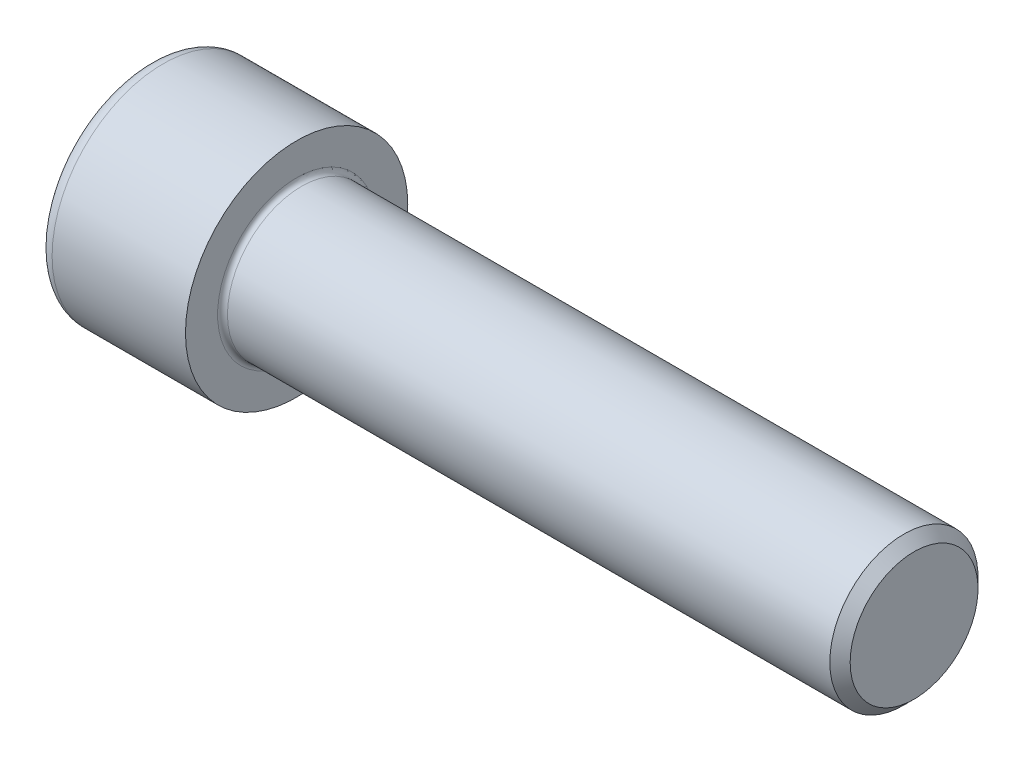
ISO-10303-21;
HEADER;
FILE_DESCRIPTION(('STEP AP214'),'2;1');
FILE_NAME('part.step','',(''),(''),'','','');
FILE_SCHEMA(('AUTOMOTIVE_DESIGN { 1 0 10303 214 1 1 1 1 }'));
ENDSEC;
DATA;
#1=APPLICATION_CONTEXT('core data for automotive mechanical design processes');
#2=APPLICATION_PROTOCOL_DEFINITION('international standard','automotive_design',2000,#1);
#3=PRODUCT_CONTEXT('',#1,'mechanical');
#4=PRODUCT('Part','Part','',(#3));
#5=PRODUCT_RELATED_PRODUCT_CATEGORY('part','',(#4));
#6=PRODUCT_DEFINITION_FORMATION('','',#4);
#7=PRODUCT_DEFINITION_CONTEXT('part definition',#1,'design');
#8=PRODUCT_DEFINITION('design','',#6,#7);
#9=PRODUCT_DEFINITION_SHAPE('','',#8);
#10=(LENGTH_UNIT() NAMED_UNIT(*) SI_UNIT(.MILLI.,.METRE.));
#11=(NAMED_UNIT(*) PLANE_ANGLE_UNIT() SI_UNIT($,.RADIAN.));
#12=(NAMED_UNIT(*) SI_UNIT($,.STERADIAN.) SOLID_ANGLE_UNIT());
#13=UNCERTAINTY_MEASURE_WITH_UNIT(LENGTH_MEASURE(1.E-05),#10,'distance_accuracy_value','');
#14=(GEOMETRIC_REPRESENTATION_CONTEXT(3) GLOBAL_UNCERTAINTY_ASSIGNED_CONTEXT((#13)) GLOBAL_UNIT_ASSIGNED_CONTEXT((#10,
#11,#12)) REPRESENTATION_CONTEXT('',''));
#15=CARTESIAN_POINT('',(0.,0.,0.));
#16=DIRECTION('',(0.,0.,1.));
#17=DIRECTION('',(1.,0.,0.));
#18=AXIS2_PLACEMENT_3D('',#15,#16,#17);
#19=CARTESIAN_POINT('',(12.,10.9696551146029,0.));
#20=DIRECTION('',(1.,0.,0.));
#21=DIRECTION('',(0.,0.,-1.));
#22=AXIS2_PLACEMENT_3D('',#19,#20,#21);
#23=PLANE('',#22);
#24=CARTESIAN_POINT('',(12.,0.,0.));
#25=DIRECTION('',(1.,0.,0.));
#26=DIRECTION('',(0.,0.,-1.));
#27=AXIS2_PLACEMENT_3D('',#24,#25,#26);
#28=CIRCLE('',#27,9.5);
#29=CARTESIAN_POINT('',(12.,0.,-9.5));
#30=VERTEX_POINT('',#29);
#31=CARTESIAN_POINT('',(12.,-8.22724133595217,-4.75));
#32=VERTEX_POINT('',#31);
#33=EDGE_CURVE('E156',#30,#32,#28,.F.);
#34=ORIENTED_EDGE('',*,*,#33,.F.);
#35=DIRECTION('',(0.,1.,0.));
#36=VECTOR('',#35,1.);
#37=CARTESIAN_POINT('',(12.,-5.48482755730145,-9.5));
#38=LINE('',#37,#36);
#39=CARTESIAN_POINT('',(12.,-5.48482755730145,-9.5));
#40=VERTEX_POINT('',#39);
#41=EDGE_CURVE('E187',#40,#30,#38,.T.);
#42=ORIENTED_EDGE('',*,*,#41,.F.);
#43=DIRECTION('',(0.,0.5,-0.866025403784439));
#44=VECTOR('',#43,1.);
#45=CARTESIAN_POINT('',(12.,-10.9696551146029,0.));
#46=LINE('',#45,#44);
#47=EDGE_CURVE('E183',#32,#40,#46,.T.);
#48=ORIENTED_EDGE('',*,*,#47,.F.);
#49=EDGE_LOOP('',(#34,#42,#48));
#50=FACE_BOUND('',#49,.T.);
#51=ADVANCED_FACE('F34',(#50),#23,.F.);
#52=CARTESIAN_POINT('',(12.,-8.22724133595216,4.75));
#53=VERTEX_POINT('',#52);
#54=EDGE_CURVE('E262',#32,#53,#28,.F.);
#55=ORIENTED_EDGE('',*,*,#54,.F.);
#56=CARTESIAN_POINT('',(12.,-10.9696551146029,0.));
#57=VERTEX_POINT('',#56);
#58=EDGE_CURVE('E184',#57,#32,#46,.T.);
#59=ORIENTED_EDGE('',*,*,#58,.F.);
#60=DIRECTION('',(0.,-0.5,-0.866025403784438));
#61=VECTOR('',#60,1.);
#62=CARTESIAN_POINT('',(12.,-5.48482755730144,9.5));
#63=LINE('',#62,#61);
#64=EDGE_CURVE('E179',#53,#57,#63,.T.);
#65=ORIENTED_EDGE('',*,*,#64,.F.);
#66=EDGE_LOOP('',(#55,#59,#65));
#67=FACE_BOUND('',#66,.T.);
#68=ADVANCED_FACE('F123',(#67),#23,.F.);
#69=CARTESIAN_POINT('',(12.,0.,9.5));
#70=VERTEX_POINT('',#69);
#71=EDGE_CURVE('E263',#53,#70,#28,.F.);
#72=ORIENTED_EDGE('',*,*,#71,.F.);
#73=CARTESIAN_POINT('',(12.,-5.48482755730144,9.5));
#74=VERTEX_POINT('',#73);
#75=EDGE_CURVE('E180',#74,#53,#63,.T.);
#76=ORIENTED_EDGE('',*,*,#75,.F.);
#77=DIRECTION('',(0.,-1.,0.));
#78=VECTOR('',#77,1.);
#79=CARTESIAN_POINT('',(12.,5.48482755730145,9.5));
#80=LINE('',#79,#78);
#81=EDGE_CURVE('E175',#70,#74,#80,.T.);
#82=ORIENTED_EDGE('',*,*,#81,.F.);
#83=EDGE_LOOP('',(#72,#76,#82));
#84=FACE_BOUND('',#83,.T.);
#85=ADVANCED_FACE('F129',(#84),#23,.F.);
#86=CARTESIAN_POINT('',(12.,8.22724133595217,4.75));
#87=VERTEX_POINT('',#86);
#88=EDGE_CURVE('E265',#70,#87,#28,.F.);
#89=ORIENTED_EDGE('',*,*,#88,.F.);
#90=CARTESIAN_POINT('',(12.,5.48482755730145,9.5));
#91=VERTEX_POINT('',#90);
#92=EDGE_CURVE('E176',#91,#70,#80,.T.);
#93=ORIENTED_EDGE('',*,*,#92,.F.);
#94=DIRECTION('',(0.,-0.5,0.866025403784439));
#95=VECTOR('',#94,1.);
#96=CARTESIAN_POINT('',(12.,10.9696551146029,0.));
#97=LINE('',#96,#95);
#98=EDGE_CURVE('E170',#87,#91,#97,.T.);
#99=ORIENTED_EDGE('',*,*,#98,.F.);
#100=EDGE_LOOP('',(#89,#93,#99));
#101=FACE_BOUND('',#100,.T.);
#102=ADVANCED_FACE('F144',(#101),#23,.F.);
#103=CARTESIAN_POINT('',(12.,8.22724133595217,-4.75));
#104=VERTEX_POINT('',#103);
#105=EDGE_CURVE('E49',#87,#104,#28,.F.);
#106=ORIENTED_EDGE('',*,*,#105,.F.);
#107=CARTESIAN_POINT('',(12.,10.9696551146029,0.));
#108=VERTEX_POINT('',#107);
#109=EDGE_CURVE('E161',#108,#87,#97,.T.);
#110=ORIENTED_EDGE('',*,*,#109,.F.);
#111=DIRECTION('',(0.,0.5,0.866025403784439));
#112=VECTOR('',#111,1.);
#113=CARTESIAN_POINT('',(12.,5.48482755730145,-9.5));
#114=LINE('',#113,#112);
#115=EDGE_CURVE('E158',#104,#108,#114,.T.);
#116=ORIENTED_EDGE('',*,*,#115,.F.);
#117=EDGE_LOOP('',(#106,#110,#116));
#118=FACE_BOUND('',#117,.T.);
#119=ADVANCED_FACE('F135',(#118),#23,.F.);
#120=EDGE_CURVE('E148',#104,#30,#28,.F.);
#121=ORIENTED_EDGE('',*,*,#120,.F.);
#122=CARTESIAN_POINT('',(12.,5.48482755730145,-9.5));
#123=VERTEX_POINT('',#122);
#124=EDGE_CURVE('E151',#123,#104,#114,.T.);
#125=ORIENTED_EDGE('',*,*,#124,.F.);
#126=EDGE_CURVE('E152',#30,#123,#38,.T.);
#127=ORIENTED_EDGE('',*,*,#126,.F.);
#128=EDGE_LOOP('',(#121,#125,#127));
#129=FACE_BOUND('',#128,.T.);
#130=ADVANCED_FACE('F125',(#129),#23,.F.);
#131=CARTESIAN_POINT('',(0.,0.,0.));
#132=DIRECTION('',(1.,0.,0.));
#133=DIRECTION('',(0.,0.,-1.));
#134=AXIS2_PLACEMENT_3D('',#131,#132,#133);
#135=PLANE('',#134);
#136=CARTESIAN_POINT('',(0.,0.,0.));
#137=DIRECTION('',(1.,0.,0.));
#138=DIRECTION('',(0.,0.,-1.));
#139=AXIS2_PLACEMENT_3D('',#136,#137,#138);
#140=CIRCLE('',#139,15.6);
#141=CARTESIAN_POINT('',(0.,0.,-15.6));
#142=VERTEX_POINT('',#141);
#143=EDGE_CURVE('E11',#142,#142,#140,.F.);
#144=ORIENTED_EDGE('',*,*,#143,.T.);
#145=EDGE_LOOP('',(#144));
#146=FACE_BOUND('',#145,.T.);
#147=DIRECTION('',(0.,0.5,0.866025403784439));
#148=VECTOR('',#147,1.);
#149=CARTESIAN_POINT('',(0.,5.48482755730145,-9.5));
#150=LINE('',#149,#148);
#151=CARTESIAN_POINT('',(0.,5.48482755730145,-9.5));
#152=VERTEX_POINT('',#151);
#153=CARTESIAN_POINT('',(0.,10.9696551146029,0.));
#154=VERTEX_POINT('',#153);
#155=EDGE_CURVE('E189',#152,#154,#150,.T.);
#156=ORIENTED_EDGE('',*,*,#155,.T.);
#157=DIRECTION('',(0.,-0.5,0.866025403784439));
#158=VECTOR('',#157,1.);
#159=CARTESIAN_POINT('',(0.,10.9696551146029,0.));
#160=LINE('',#159,#158);
#161=CARTESIAN_POINT('',(0.,5.48482755730145,9.5));
#162=VERTEX_POINT('',#161);
#163=EDGE_CURVE('E191',#154,#162,#160,.T.);
#164=ORIENTED_EDGE('',*,*,#163,.T.);
#165=DIRECTION('',(0.,-1.,0.));
#166=VECTOR('',#165,1.);
#167=CARTESIAN_POINT('',(0.,5.48482755730145,9.5));
#168=LINE('',#167,#166);
#169=CARTESIAN_POINT('',(0.,-5.48482755730144,9.5));
#170=VERTEX_POINT('',#169);
#171=EDGE_CURVE('E193',#162,#170,#168,.T.);
#172=ORIENTED_EDGE('',*,*,#171,.T.);
#173=DIRECTION('',(0.,-0.5,-0.866025403784438));
#174=VECTOR('',#173,1.);
#175=CARTESIAN_POINT('',(0.,-5.48482755730144,9.5));
#176=LINE('',#175,#174);
#177=CARTESIAN_POINT('',(0.,-10.9696551146029,0.));
#178=VERTEX_POINT('',#177);
#179=EDGE_CURVE('E195',#170,#178,#176,.T.);
#180=ORIENTED_EDGE('',*,*,#179,.T.);
#181=DIRECTION('',(0.,0.5,-0.866025403784439));
#182=VECTOR('',#181,1.);
#183=CARTESIAN_POINT('',(0.,-10.9696551146029,0.));
#184=LINE('',#183,#182);
#185=CARTESIAN_POINT('',(0.,-5.48482755730145,-9.5));
#186=VERTEX_POINT('',#185);
#187=EDGE_CURVE('E197',#178,#186,#184,.T.);
#188=ORIENTED_EDGE('',*,*,#187,.T.);
#189=DIRECTION('',(0.,1.,0.));
#190=VECTOR('',#189,1.);
#191=CARTESIAN_POINT('',(0.,-5.48482755730145,-9.5));
#192=LINE('',#191,#190);
#193=EDGE_CURVE('E57',#186,#152,#192,.T.);
#194=ORIENTED_EDGE('',*,*,#193,.T.);
#195=EDGE_LOOP('',(#156,#164,#172,#180,#188,#194));
#196=FACE_BOUND('',#195,.T.);
#197=ADVANCED_FACE('F134',(#146,#196),#135,.F.);
#198=CARTESIAN_POINT('',(24.,0.,0.));
#199=DIRECTION('',(1.,0.,0.));
#200=DIRECTION('',(0.,0.,-1.));
#201=AXIS2_PLACEMENT_3D('',#198,#199,#200);
#202=PLANE('',#201);
#203=CARTESIAN_POINT('',(24.,0.,0.));
#204=DIRECTION('',(1.,0.,0.));
#205=DIRECTION('',(0.,0.,-1.));
#206=AXIS2_PLACEMENT_3D('',#203,#204,#205);
#207=CIRCLE('',#206,12.8);
#208=CARTESIAN_POINT('',(24.,0.,-12.8));
#209=VERTEX_POINT('',#208);
#210=EDGE_CURVE('E223',#209,#209,#207,.F.);
#211=ORIENTED_EDGE('',*,*,#210,.T.);
#212=EDGE_LOOP('',(#211));
#213=FACE_BOUND('',#212,.T.);
#214=CARTESIAN_POINT('',(24.,0.,0.));
#215=DIRECTION('',(1.,0.,0.));
#216=DIRECTION('',(0.,0.,-1.));
#217=AXIS2_PLACEMENT_3D('',#214,#215,#216);
#218=CIRCLE('',#217,18.);
#219=CARTESIAN_POINT('',(24.,0.,-18.));
#220=VERTEX_POINT('',#219);
#221=EDGE_CURVE('E154',#220,#220,#218,.T.);
#222=ORIENTED_EDGE('',*,*,#221,.T.);
#223=EDGE_LOOP('',(#222));
#224=FACE_BOUND('',#223,.T.);
#225=ADVANCED_FACE('F141',(#213,#224),#202,.T.);
#226=CARTESIAN_POINT('',(24.,0.,0.));
#227=DIRECTION('',(-1.,0.,0.));
#228=DIRECTION('',(0.,0.,1.));
#229=AXIS2_PLACEMENT_3D('',#226,#227,#228);
#230=CYLINDRICAL_SURFACE('',#229,18.);
#231=CARTESIAN_POINT('',(2.4,0.,0.));
#232=DIRECTION('',(1.,0.,0.));
#233=DIRECTION('',(0.,0.,-1.));
#234=AXIS2_PLACEMENT_3D('',#231,#232,#233);
#235=CIRCLE('',#234,18.);
#236=CARTESIAN_POINT('',(2.4,0.,-18.));
#237=VERTEX_POINT('',#236);
#238=EDGE_CURVE('E42',#237,#237,#235,.T.);
#239=ORIENTED_EDGE('',*,*,#238,.T.);
#240=EDGE_LOOP('',(#239));
#241=FACE_BOUND('',#240,.T.);
#242=ORIENTED_EDGE('',*,*,#221,.F.);
#243=EDGE_LOOP('',(#242));
#244=FACE_BOUND('',#243,.T.);
#245=ADVANCED_FACE('F231',(#241,#244),#230,.T.);
#246=CARTESIAN_POINT('',(124.,0.,0.));
#247=DIRECTION('',(-1.,0.,0.));
#248=DIRECTION('',(0.,0.,1.));
#249=AXIS2_PLACEMENT_3D('',#246,#247,#248);
#250=PLANE('',#249);
#251=CARTESIAN_POINT('',(124.,0.,0.));
#252=DIRECTION('',(-1.,0.,0.));
#253=DIRECTION('',(0.,0.,1.));
#254=AXIS2_PLACEMENT_3D('',#251,#252,#253);
#255=CIRCLE('',#254,10.352);
#256=CARTESIAN_POINT('',(124.,0.,10.352));
#257=VERTEX_POINT('',#256);
#258=EDGE_CURVE('E218',#257,#257,#255,.T.);
#259=ORIENTED_EDGE('',*,*,#258,.F.);
#260=EDGE_LOOP('',(#259));
#261=FACE_BOUND('',#260,.T.);
#262=ADVANCED_FACE('F388',(#261),#250,.F.);
#263=CARTESIAN_POINT('',(124.,0.,0.));
#264=DIRECTION('',(-1.,0.,0.));
#265=DIRECTION('',(0.,0.,1.));
#266=AXIS2_PLACEMENT_3D('',#263,#264,#265);
#267=CONICAL_SURFACE('',#266,10.352,0.785398163397446);
#268=CARTESIAN_POINT('',(122.352,0.,0.));
#269=DIRECTION('',(-1.,0.,0.));
#270=DIRECTION('',(0.,0.,1.));
#271=AXIS2_PLACEMENT_3D('',#268,#269,#270);
#272=CIRCLE('',#271,12.);
#273=CARTESIAN_POINT('',(122.352,0.,12.));
#274=VERTEX_POINT('',#273);
#275=EDGE_CURVE('E215',#274,#274,#272,.T.);
#276=ORIENTED_EDGE('',*,*,#275,.F.);
#277=EDGE_LOOP('',(#276));
#278=FACE_BOUND('',#277,.T.);
#279=ORIENTED_EDGE('',*,*,#258,.T.);
#280=EDGE_LOOP('',(#279));
#281=FACE_BOUND('',#280,.T.);
#282=ADVANCED_FACE('F368',(#278,#281),#267,.T.);
#283=CARTESIAN_POINT('',(0.,0.,0.));
#284=DIRECTION('',(-1.,0.,0.));
#285=DIRECTION('',(0.,0.,1.));
#286=AXIS2_PLACEMENT_3D('',#283,#284,#285);
#287=CYLINDRICAL_SURFACE('',#286,12.);
#288=CARTESIAN_POINT('',(24.8,0.,0.));
#289=DIRECTION('',(1.,0.,0.));
#290=DIRECTION('',(0.,0.,-1.));
#291=AXIS2_PLACEMENT_3D('',#288,#289,#290);
#292=CIRCLE('',#291,12.);
#293=CARTESIAN_POINT('',(24.8,0.,-12.));
#294=VERTEX_POINT('',#293);
#295=EDGE_CURVE('E226',#294,#294,#292,.T.);
#296=ORIENTED_EDGE('',*,*,#295,.T.);
#297=EDGE_LOOP('',(#296));
#298=FACE_BOUND('',#297,.T.);
#299=ORIENTED_EDGE('',*,*,#275,.T.);
#300=EDGE_LOOP('',(#299));
#301=FACE_BOUND('',#300,.T.);
#302=ADVANCED_FACE('F295',(#298,#301),#287,.T.);
#303=CARTESIAN_POINT('',(12.,5.48482755730145,-9.5));
#304=DIRECTION('',(0.,-0.866025403784438,0.5));
#305=DIRECTION('',(0.,-0.5,-0.866025403784439));
#306=AXIS2_PLACEMENT_3D('',#303,#304,#305);
#307=PLANE('',#306);
#308=ORIENTED_EDGE('',*,*,#124,.T.);
#309=ORIENTED_EDGE('',*,*,#115,.T.);
#310=DIRECTION('',(-1.,0.,0.));
#311=VECTOR('',#310,1.);
#312=CARTESIAN_POINT('',(12.,10.9696551146029,0.));
#313=LINE('',#312,#311);
#314=EDGE_CURVE('E213',#108,#154,#313,.T.);
#315=ORIENTED_EDGE('',*,*,#314,.T.);
#316=ORIENTED_EDGE('',*,*,#155,.F.);
#317=DIRECTION('',(-1.,0.,0.));
#318=VECTOR('',#317,1.);
#319=CARTESIAN_POINT('',(12.,5.48482755730145,-9.5));
#320=LINE('',#319,#318);
#321=EDGE_CURVE('E169',#123,#152,#320,.T.);
#322=ORIENTED_EDGE('',*,*,#321,.F.);
#323=EDGE_LOOP('',(#308,#309,#315,#316,#322));
#324=FACE_BOUND('',#323,.T.);
#325=ADVANCED_FACE('F167',(#324),#307,.T.);
#326=CARTESIAN_POINT('',(12.,10.9696551146029,0.));
#327=DIRECTION('',(0.,-0.866025403784439,-0.5));
#328=DIRECTION('',(0.,0.5,-0.866025403784439));
#329=AXIS2_PLACEMENT_3D('',#326,#327,#328);
#330=PLANE('',#329);
#331=ORIENTED_EDGE('',*,*,#109,.T.);
#332=ORIENTED_EDGE('',*,*,#98,.T.);
#333=DIRECTION('',(-1.,0.,0.));
#334=VECTOR('',#333,1.);
#335=CARTESIAN_POINT('',(12.,5.48482755730145,9.5));
#336=LINE('',#335,#334);
#337=EDGE_CURVE('E210',#91,#162,#336,.T.);
#338=ORIENTED_EDGE('',*,*,#337,.T.);
#339=ORIENTED_EDGE('',*,*,#163,.F.);
#340=ORIENTED_EDGE('',*,*,#314,.F.);
#341=EDGE_LOOP('',(#331,#332,#338,#339,#340));
#342=FACE_BOUND('',#341,.T.);
#343=ADVANCED_FACE('F241',(#342),#330,.T.);
#344=CARTESIAN_POINT('',(12.,5.48482755730145,9.5));
#345=DIRECTION('',(0.,0.,-1.));
#346=DIRECTION('',(-1.,0.,0.));
#347=AXIS2_PLACEMENT_3D('',#344,#345,#346);
#348=PLANE('',#347);
#349=ORIENTED_EDGE('',*,*,#92,.T.);
#350=ORIENTED_EDGE('',*,*,#81,.T.);
#351=DIRECTION('',(-1.,0.,0.));
#352=VECTOR('',#351,1.);
#353=CARTESIAN_POINT('',(12.,-5.48482755730144,9.5));
#354=LINE('',#353,#352);
#355=EDGE_CURVE('E207',#74,#170,#354,.T.);
#356=ORIENTED_EDGE('',*,*,#355,.T.);
#357=ORIENTED_EDGE('',*,*,#171,.F.);
#358=ORIENTED_EDGE('',*,*,#337,.F.);
#359=EDGE_LOOP('',(#349,#350,#356,#357,#358));
#360=FACE_BOUND('',#359,.T.);
#361=ADVANCED_FACE('F246',(#360),#348,.T.);
#362=CARTESIAN_POINT('',(12.,-5.48482755730144,9.5));
#363=DIRECTION('',(0.,0.866025403784439,-0.5));
#364=DIRECTION('',(0.,0.5,0.866025403784439));
#365=AXIS2_PLACEMENT_3D('',#362,#363,#364);
#366=PLANE('',#365);
#367=ORIENTED_EDGE('',*,*,#75,.T.);
#368=ORIENTED_EDGE('',*,*,#64,.T.);
#369=DIRECTION('',(-1.,0.,0.));
#370=VECTOR('',#369,1.);
#371=CARTESIAN_POINT('',(12.,-10.9696551146029,0.));
#372=LINE('',#371,#370);
#373=EDGE_CURVE('E204',#57,#178,#372,.T.);
#374=ORIENTED_EDGE('',*,*,#373,.T.);
#375=ORIENTED_EDGE('',*,*,#179,.F.);
#376=ORIENTED_EDGE('',*,*,#355,.F.);
#377=EDGE_LOOP('',(#367,#368,#374,#375,#376));
#378=FACE_BOUND('',#377,.T.);
#379=ADVANCED_FACE('F252',(#378),#366,.T.);
#380=CARTESIAN_POINT('',(12.,-10.9696551146029,0.));
#381=DIRECTION('',(0.,0.866025403784439,0.5));
#382=DIRECTION('',(0.,-0.5,0.866025403784439));
#383=AXIS2_PLACEMENT_3D('',#380,#381,#382);
#384=PLANE('',#383);
#385=ORIENTED_EDGE('',*,*,#58,.T.);
#386=ORIENTED_EDGE('',*,*,#47,.T.);
#387=DIRECTION('',(-1.,0.,0.));
#388=VECTOR('',#387,1.);
#389=CARTESIAN_POINT('',(12.,-5.48482755730145,-9.5));
#390=LINE('',#389,#388);
#391=EDGE_CURVE('E201',#40,#186,#390,.T.);
#392=ORIENTED_EDGE('',*,*,#391,.T.);
#393=ORIENTED_EDGE('',*,*,#187,.F.);
#394=ORIENTED_EDGE('',*,*,#373,.F.);
#395=EDGE_LOOP('',(#385,#386,#392,#393,#394));
#396=FACE_BOUND('',#395,.T.);
#397=ADVANCED_FACE('F256',(#396),#384,.T.);
#398=CARTESIAN_POINT('',(12.,-5.48482755730145,-9.5));
#399=DIRECTION('',(0.,0.,1.));
#400=DIRECTION('',(0.,-1.,0.));
#401=AXIS2_PLACEMENT_3D('',#398,#399,#400);
#402=PLANE('',#401);
#403=ORIENTED_EDGE('',*,*,#41,.T.);
#404=ORIENTED_EDGE('',*,*,#126,.T.);
#405=ORIENTED_EDGE('',*,*,#321,.T.);
#406=ORIENTED_EDGE('',*,*,#193,.F.);
#407=ORIENTED_EDGE('',*,*,#391,.F.);
#408=EDGE_LOOP('',(#403,#404,#405,#406,#407));
#409=FACE_BOUND('',#408,.T.);
#410=ADVANCED_FACE('F117',(#409),#402,.T.);
#411=CARTESIAN_POINT('',(0.,0.,0.));
#412=DIRECTION('',(-1.,0.,0.));
#413=DIRECTION('',(0.,0.,1.));
#414=AXIS2_PLACEMENT_3D('',#411,#412,#413);
#415=CYLINDRICAL_SURFACE('',#414,9.5);
#416=CARTESIAN_POINT('',(13.6,0.,0.));
#417=DIRECTION('',(-1.,0.,0.));
#418=DIRECTION('',(0.,0.,1.));
#419=AXIS2_PLACEMENT_3D('',#416,#417,#418);
#420=CIRCLE('',#419,9.5);
#421=CARTESIAN_POINT('',(13.6,0.,9.5));
#422=VERTEX_POINT('',#421);
#423=EDGE_CURVE('E173',#422,#422,#420,.T.);
#424=ORIENTED_EDGE('',*,*,#423,.F.);
#425=EDGE_LOOP('',(#424));
#426=FACE_BOUND('',#425,.T.);
#427=ORIENTED_EDGE('',*,*,#33,.T.);
#428=ORIENTED_EDGE('',*,*,#54,.T.);
#429=ORIENTED_EDGE('',*,*,#71,.T.);
#430=ORIENTED_EDGE('',*,*,#88,.T.);
#431=ORIENTED_EDGE('',*,*,#105,.T.);
#432=ORIENTED_EDGE('',*,*,#120,.T.);
#433=EDGE_LOOP('',(#427,#428,#429,#430,#431,#432));
#434=FACE_BOUND('',#433,.T.);
#435=ADVANCED_FACE('F109',(#426,#434),#415,.F.);
#436=CARTESIAN_POINT('',(19.0848275573015,0.,0.));
#437=DIRECTION('',(-1.,0.,0.));
#438=DIRECTION('',(0.,0.,1.));
#439=AXIS2_PLACEMENT_3D('',#436,#437,#438);
#440=CONICAL_SURFACE('',#439,0.,1.04719755119659);
#441=ORIENTED_EDGE('',*,*,#423,.T.);
#442=EDGE_LOOP('',(#441));
#443=FACE_BOUND('',#442,.T.);
#444=CARTESIAN_POINT('',(19.0848275573015,0.,0.));
#445=VERTEX_POINT('',#444);
#446=VERTEX_LOOP('',#445);
#447=FACE_BOUND('',#446,.T.);
#448=ADVANCED_FACE('F106',(#443,#447),#440,.F.);
#449=CARTESIAN_POINT('',(24.8,0.,0.));
#450=DIRECTION('',(1.,0.,0.));
#451=DIRECTION('',(0.,0.,-1.));
#452=AXIS2_PLACEMENT_3D('',#449,#450,#451);
#453=TOROIDAL_SURFACE('',#452,12.8,0.8);
#454=ORIENTED_EDGE('',*,*,#295,.F.);
#455=EDGE_LOOP('',(#454));
#456=FACE_BOUND('',#455,.T.);
#457=ORIENTED_EDGE('',*,*,#210,.F.);
#458=EDGE_LOOP('',(#457));
#459=FACE_BOUND('',#458,.T.);
#460=ADVANCED_FACE('F108',(#456,#459),#453,.F.);
#461=CARTESIAN_POINT('',(2.4,0.,0.));
#462=DIRECTION('',(1.,0.,0.));
#463=DIRECTION('',(0.,0.,-1.));
#464=AXIS2_PLACEMENT_3D('',#461,#462,#463);
#465=TOROIDAL_SURFACE('',#464,15.6,2.4);
#466=ORIENTED_EDGE('',*,*,#143,.F.);
#467=EDGE_LOOP('',(#466));
#468=FACE_BOUND('',#467,.T.);
#469=ORIENTED_EDGE('',*,*,#238,.F.);
#470=EDGE_LOOP('',(#469));
#471=FACE_BOUND('',#470,.T.);
#472=ADVANCED_FACE('F36',(#468,#471),#465,.T.);
#473=CLOSED_SHELL('',(#51,#68,#85,#102,#119,#130,#197,#225,#245,#262,#282,#302,#325,#343,#361,
#379,#397,#410,#435,#448,#460,#472));
#474=MANIFOLD_SOLID_BREP('B2',#473);
#475=ADVANCED_BREP_SHAPE_REPRESENTATION('',(#18,#474),#14);
#476=SHAPE_DEFINITION_REPRESENTATION(#9,#475);
ENDSEC;
END-ISO-10303-21;
